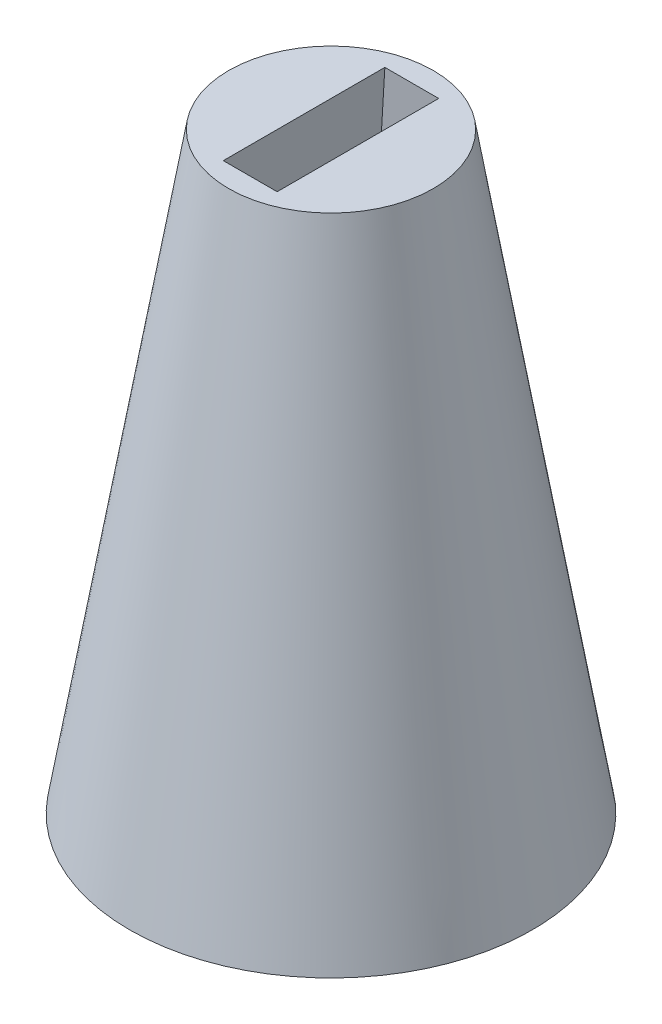
ISO-10303-21;
HEADER;
FILE_DESCRIPTION(('STEP AP214'),'2;1');
FILE_NAME('part.step','',(''),(''),'','','');
FILE_SCHEMA(('AUTOMOTIVE_DESIGN { 1 0 10303 214 1 1 1 1 }'));
ENDSEC;
DATA;
#1=APPLICATION_CONTEXT('core data for automotive mechanical design processes');
#2=APPLICATION_PROTOCOL_DEFINITION('international standard','automotive_design',2000,#1);
#3=PRODUCT_CONTEXT('',#1,'mechanical');
#4=PRODUCT('Part','Part','',(#3));
#5=PRODUCT_RELATED_PRODUCT_CATEGORY('part','',(#4));
#6=PRODUCT_DEFINITION_FORMATION('','',#4);
#7=PRODUCT_DEFINITION_CONTEXT('part definition',#1,'design');
#8=PRODUCT_DEFINITION('design','',#6,#7);
#9=PRODUCT_DEFINITION_SHAPE('','',#8);
#10=(LENGTH_UNIT() NAMED_UNIT(*) SI_UNIT(.MILLI.,.METRE.));
#11=(NAMED_UNIT(*) PLANE_ANGLE_UNIT() SI_UNIT($,.RADIAN.));
#12=(NAMED_UNIT(*) SI_UNIT($,.STERADIAN.) SOLID_ANGLE_UNIT());
#13=UNCERTAINTY_MEASURE_WITH_UNIT(LENGTH_MEASURE(1.E-05),#10,'distance_accuracy_value','');
#14=(GEOMETRIC_REPRESENTATION_CONTEXT(3) GLOBAL_UNCERTAINTY_ASSIGNED_CONTEXT((#13)) GLOBAL_UNIT_ASSIGNED_CONTEXT((#10,
#11,#12)) REPRESENTATION_CONTEXT('',''));
#15=CARTESIAN_POINT('',(0.,0.,0.));
#16=DIRECTION('',(0.,0.,1.));
#17=DIRECTION('',(1.,0.,0.));
#18=AXIS2_PLACEMENT_3D('',#15,#16,#17);
#19=CARTESIAN_POINT('',(0.,55.,0.));
#20=DIRECTION('',(0.,1.,0.));
#21=DIRECTION('',(0.,0.,1.));
#22=AXIS2_PLACEMENT_3D('',#19,#20,#21);
#23=PLANE('',#22);
#24=CARTESIAN_POINT('',(0.,55.,0.));
#25=DIRECTION('',(0.,1.,0.));
#26=DIRECTION('',(0.,0.,1.));
#27=AXIS2_PLACEMENT_3D('',#24,#25,#26);
#28=CIRCLE('',#27,9.5);
#29=CARTESIAN_POINT('',(0.,55.,9.5));
#30=VERTEX_POINT('',#29);
#31=EDGE_CURVE('E64',#30,#30,#28,.T.);
#32=ORIENTED_EDGE('',*,*,#31,.T.);
#33=EDGE_LOOP('',(#32));
#34=FACE_BOUND('',#33,.T.);
#35=DIRECTION('',(1.,0.,0.));
#36=VECTOR('',#35,1.);
#37=CARTESIAN_POINT('',(-2.5,55.,7.5));
#38=LINE('',#37,#36);
#39=CARTESIAN_POINT('',(-2.5,55.,7.5));
#40=VERTEX_POINT('',#39);
#41=CARTESIAN_POINT('',(2.5,55.,7.5));
#42=VERTEX_POINT('',#41);
#43=EDGE_CURVE('E335',#40,#42,#38,.T.);
#44=ORIENTED_EDGE('',*,*,#43,.F.);
#45=DIRECTION('',(0.,0.,1.));
#46=VECTOR('',#45,1.);
#47=CARTESIAN_POINT('',(-2.5,55.,-7.5));
#48=LINE('',#47,#46);
#49=CARTESIAN_POINT('',(-2.5,55.,-7.5));
#50=VERTEX_POINT('',#49);
#51=EDGE_CURVE('E121',#50,#40,#48,.T.);
#52=ORIENTED_EDGE('',*,*,#51,.F.);
#53=DIRECTION('',(-1.,0.,0.));
#54=VECTOR('',#53,1.);
#55=CARTESIAN_POINT('',(-2.5,55.,-7.5));
#56=LINE('',#55,#54);
#57=CARTESIAN_POINT('',(2.5,55.,-7.5));
#58=VERTEX_POINT('',#57);
#59=EDGE_CURVE('E330',#58,#50,#56,.T.);
#60=ORIENTED_EDGE('',*,*,#59,.F.);
#61=DIRECTION('',(0.,0.,-1.));
#62=VECTOR('',#61,1.);
#63=CARTESIAN_POINT('',(2.5,55.,-7.5));
#64=LINE('',#63,#62);
#65=EDGE_CURVE('E164',#42,#58,#64,.T.);
#66=ORIENTED_EDGE('',*,*,#65,.F.);
#67=EDGE_LOOP('',(#44,#52,#60,#66));
#68=FACE_BOUND('',#67,.T.);
#69=ADVANCED_FACE('F53',(#34,#68),#23,.T.);
#70=CARTESIAN_POINT('',(0.,0.,0.));
#71=DIRECTION('',(0.,1.,0.));
#72=DIRECTION('',(0.,0.,1.));
#73=AXIS2_PLACEMENT_3D('',#70,#71,#72);
#74=PLANE('',#73);
#75=DIRECTION('',(-1.,0.,0.));
#76=VECTOR('',#75,1.);
#77=CARTESIAN_POINT('',(-5.75,0.,9.5));
#78=LINE('',#77,#76);
#79=CARTESIAN_POINT('',(5.75,0.,9.5));
#80=VERTEX_POINT('',#79);
#81=CARTESIAN_POINT('',(-5.75,0.,9.5));
#82=VERTEX_POINT('',#81);
#83=EDGE_CURVE('E143',#80,#82,#78,.T.);
#84=ORIENTED_EDGE('',*,*,#83,.F.);
#85=DIRECTION('',(0.,0.,1.));
#86=VECTOR('',#85,1.);
#87=CARTESIAN_POINT('',(5.75,0.,9.5));
#88=LINE('',#87,#86);
#89=CARTESIAN_POINT('',(5.75000000000001,0.,-9.5));
#90=VERTEX_POINT('',#89);
#91=EDGE_CURVE('E80',#90,#80,#88,.T.);
#92=ORIENTED_EDGE('',*,*,#91,.F.);
#93=DIRECTION('',(1.,0.,0.));
#94=VECTOR('',#93,1.);
#95=CARTESIAN_POINT('',(-5.75,0.,-9.5));
#96=LINE('',#95,#94);
#97=CARTESIAN_POINT('',(-5.75,0.,-9.5));
#98=VERTEX_POINT('',#97);
#99=EDGE_CURVE('E202',#98,#90,#96,.T.);
#100=ORIENTED_EDGE('',*,*,#99,.F.);
#101=DIRECTION('',(0.,0.,-1.));
#102=VECTOR('',#101,1.);
#103=CARTESIAN_POINT('',(-5.75,0.,9.5));
#104=LINE('',#103,#102);
#105=EDGE_CURVE('E323',#82,#98,#104,.T.);
#106=ORIENTED_EDGE('',*,*,#105,.F.);
#107=EDGE_LOOP('',(#84,#92,#100,#106));
#108=FACE_BOUND('',#107,.T.);
#109=CARTESIAN_POINT('',(0.,0.,0.));
#110=DIRECTION('',(0.,1.,0.));
#111=DIRECTION('',(0.,0.,1.));
#112=AXIS2_PLACEMENT_3D('',#109,#110,#111);
#113=CIRCLE('',#112,18.7);
#114=CARTESIAN_POINT('',(0.,0.,18.7));
#115=VERTEX_POINT('',#114);
#116=EDGE_CURVE('E12',#115,#115,#113,.T.);
#117=ORIENTED_EDGE('',*,*,#116,.F.);
#118=EDGE_LOOP('',(#117));
#119=FACE_BOUND('',#118,.T.);
#120=ADVANCED_FACE('F55',(#108,#119),#74,.F.);
#121=CARTESIAN_POINT('',(0.,55.,0.));
#122=DIRECTION('',(0.,-1.,0.));
#123=DIRECTION('',(0.,0.,-1.));
#124=AXIS2_PLACEMENT_3D('',#121,#122,#123);
#125=CONICAL_SURFACE('',#124,9.5,0.165738299987808);
#126=ORIENTED_EDGE('',*,*,#31,.F.);
#127=EDGE_LOOP('',(#126));
#128=FACE_BOUND('',#127,.T.);
#129=ORIENTED_EDGE('',*,*,#116,.T.);
#130=EDGE_LOOP('',(#129));
#131=FACE_BOUND('',#130,.T.);
#132=ADVANCED_FACE('F273',(#128,#131),#125,.T.);
#133=CARTESIAN_POINT('',(5.75,32.,9.5));
#134=DIRECTION('',(1.,0.,0.));
#135=DIRECTION('',(0.,0.,-1.));
#136=AXIS2_PLACEMENT_3D('',#133,#134,#135);
#137=PLANE('',#136);
#138=ORIENTED_EDGE('',*,*,#91,.T.);
#139=DIRECTION('',(0.,-1.,0.));
#140=VECTOR('',#139,1.);
#141=CARTESIAN_POINT('',(5.75,32.,9.5));
#142=LINE('',#141,#140);
#143=CARTESIAN_POINT('',(5.75,32.,9.5));
#144=VERTEX_POINT('',#143);
#145=EDGE_CURVE('E149',#144,#80,#142,.T.);
#146=ORIENTED_EDGE('',*,*,#145,.F.);
#147=DIRECTION('',(0.,0.,1.));
#148=VECTOR('',#147,1.);
#149=CARTESIAN_POINT('',(5.75,32.,9.5));
#150=LINE('',#149,#148);
#151=CARTESIAN_POINT('',(5.75000000000001,32.,-9.5));
#152=VERTEX_POINT('',#151);
#153=EDGE_CURVE('E135',#152,#144,#150,.T.);
#154=ORIENTED_EDGE('',*,*,#153,.F.);
#155=DIRECTION('',(0.,-1.,0.));
#156=VECTOR('',#155,1.);
#157=CARTESIAN_POINT('',(5.75000000000001,32.,-9.5));
#158=LINE('',#157,#156);
#159=EDGE_CURVE('E212',#152,#90,#158,.T.);
#160=ORIENTED_EDGE('',*,*,#159,.T.);
#161=EDGE_LOOP('',(#138,#146,#154,#160));
#162=FACE_BOUND('',#161,.T.);
#163=ADVANCED_FACE('F181',(#162),#137,.F.);
#164=CARTESIAN_POINT('',(-5.75,32.,-9.5));
#165=DIRECTION('',(0.,0.,-1.));
#166=DIRECTION('',(-1.,0.,0.));
#167=AXIS2_PLACEMENT_3D('',#164,#165,#166);
#168=PLANE('',#167);
#169=ORIENTED_EDGE('',*,*,#99,.T.);
#170=ORIENTED_EDGE('',*,*,#159,.F.);
#171=DIRECTION('',(1.,0.,0.));
#172=VECTOR('',#171,1.);
#173=CARTESIAN_POINT('',(-5.75,32.,-9.5));
#174=LINE('',#173,#172);
#175=CARTESIAN_POINT('',(-5.75,32.,-9.5));
#176=VERTEX_POINT('',#175);
#177=EDGE_CURVE('E155',#176,#152,#174,.T.);
#178=ORIENTED_EDGE('',*,*,#177,.F.);
#179=DIRECTION('',(0.,-1.,0.));
#180=VECTOR('',#179,1.);
#181=CARTESIAN_POINT('',(-5.75,32.,-9.5));
#182=LINE('',#181,#180);
#183=EDGE_CURVE('E148',#176,#98,#182,.T.);
#184=ORIENTED_EDGE('',*,*,#183,.T.);
#185=EDGE_LOOP('',(#169,#170,#178,#184));
#186=FACE_BOUND('',#185,.T.);
#187=ADVANCED_FACE('F175',(#186),#168,.F.);
#188=CARTESIAN_POINT('',(-5.75,32.,9.5));
#189=DIRECTION('',(-1.,0.,0.));
#190=DIRECTION('',(0.,0.,1.));
#191=AXIS2_PLACEMENT_3D('',#188,#189,#190);
#192=PLANE('',#191);
#193=ORIENTED_EDGE('',*,*,#105,.T.);
#194=ORIENTED_EDGE('',*,*,#183,.F.);
#195=DIRECTION('',(0.,0.,-1.));
#196=VECTOR('',#195,1.);
#197=CARTESIAN_POINT('',(-5.75,32.,9.5));
#198=LINE('',#197,#196);
#199=CARTESIAN_POINT('',(-5.75,32.,9.5));
#200=VERTEX_POINT('',#199);
#201=EDGE_CURVE('E117',#200,#176,#198,.T.);
#202=ORIENTED_EDGE('',*,*,#201,.F.);
#203=DIRECTION('',(0.,-1.,0.));
#204=VECTOR('',#203,1.);
#205=CARTESIAN_POINT('',(-5.75,32.,9.5));
#206=LINE('',#205,#204);
#207=EDGE_CURVE('E140',#200,#82,#206,.T.);
#208=ORIENTED_EDGE('',*,*,#207,.T.);
#209=EDGE_LOOP('',(#193,#194,#202,#208));
#210=FACE_BOUND('',#209,.T.);
#211=ADVANCED_FACE('F152',(#210),#192,.F.);
#212=CARTESIAN_POINT('',(-5.75,32.,9.5));
#213=DIRECTION('',(0.,0.,1.));
#214=DIRECTION('',(1.,0.,0.));
#215=AXIS2_PLACEMENT_3D('',#212,#213,#214);
#216=PLANE('',#215);
#217=ORIENTED_EDGE('',*,*,#83,.T.);
#218=ORIENTED_EDGE('',*,*,#207,.F.);
#219=DIRECTION('',(-1.,0.,0.));
#220=VECTOR('',#219,1.);
#221=CARTESIAN_POINT('',(-5.75,32.,9.5));
#222=LINE('',#221,#220);
#223=EDGE_CURVE('E128',#144,#200,#222,.T.);
#224=ORIENTED_EDGE('',*,*,#223,.F.);
#225=ORIENTED_EDGE('',*,*,#145,.T.);
#226=EDGE_LOOP('',(#217,#218,#224,#225));
#227=FACE_BOUND('',#226,.T.);
#228=ADVANCED_FACE('F141',(#227),#216,.F.);
#229=CARTESIAN_POINT('',(-10.0706590988069,1.42302791613576,0.));
#230=DIRECTION('',(0.990163599913086,-0.139914421726849,0.));
#231=DIRECTION('',(0.139914421726849,0.990163599913086,0.));
#232=AXIS2_PLACEMENT_3D('',#229,#230,#231);
#233=PLANE('',#232);
#234=DIRECTION('',(0.139398665853922,0.986513635273912,-0.0857837943716444));
#235=VECTOR('',#234,1.);
#236=CARTESIAN_POINT('',(-5.75,32.,9.5));
#237=LINE('',#236,#235);
#238=EDGE_CURVE('E112',#200,#40,#237,.T.);
#239=ORIENTED_EDGE('',*,*,#238,.F.);
#240=ORIENTED_EDGE('',*,*,#201,.T.);
#241=DIRECTION('',(0.139398665853922,0.986513635273912,0.0857837943716448));
#242=VECTOR('',#241,1.);
#243=CARTESIAN_POINT('',(-5.75,32.,-9.5));
#244=LINE('',#243,#242);
#245=EDGE_CURVE('E125',#176,#50,#244,.T.);
#246=ORIENTED_EDGE('',*,*,#245,.T.);
#247=ORIENTED_EDGE('',*,*,#51,.T.);
#248=EDGE_LOOP('',(#239,#240,#246,#247));
#249=FACE_BOUND('',#248,.T.);
#250=ADVANCED_FACE('F114',(#249),#233,.T.);
#251=CARTESIAN_POINT('',(0.,1.06003752345216,-12.1904315196998));
#252=DIRECTION('',(0.,-0.0866296163648422,0.996240588195683));
#253=DIRECTION('',(0.,-0.996240588195683,-0.0866296163648422));
#254=AXIS2_PLACEMENT_3D('',#251,#252,#253);
#255=PLANE('',#254);
#256=ORIENTED_EDGE('',*,*,#245,.F.);
#257=ORIENTED_EDGE('',*,*,#177,.T.);
#258=DIRECTION('',(-0.139398665853923,0.986513635273912,0.0857837943716448));
#259=VECTOR('',#258,1.);
#260=CARTESIAN_POINT('',(5.75000000000001,32.,-9.5));
#261=LINE('',#260,#259);
#262=EDGE_CURVE('E216',#152,#58,#261,.T.);
#263=ORIENTED_EDGE('',*,*,#262,.T.);
#264=ORIENTED_EDGE('',*,*,#59,.T.);
#265=EDGE_LOOP('',(#256,#257,#263,#264));
#266=FACE_BOUND('',#265,.T.);
#267=ADVANCED_FACE('F237',(#266),#255,.T.);
#268=CARTESIAN_POINT('',(0.,1.06003752345215,12.1904315196998));
#269=DIRECTION('',(0.,-0.0866296163648418,-0.996240588195683));
#270=DIRECTION('',(0.,0.996240588195683,-0.0866296163648418));
#271=AXIS2_PLACEMENT_3D('',#268,#269,#270);
#272=PLANE('',#271);
#273=DIRECTION('',(-0.139398665853922,0.986513635273912,-0.0857837943716444));
#274=VECTOR('',#273,1.);
#275=CARTESIAN_POINT('',(5.75,32.,9.5));
#276=LINE('',#275,#274);
#277=EDGE_CURVE('E72',#144,#42,#276,.T.);
#278=ORIENTED_EDGE('',*,*,#277,.F.);
#279=ORIENTED_EDGE('',*,*,#223,.T.);
#280=ORIENTED_EDGE('',*,*,#238,.T.);
#281=ORIENTED_EDGE('',*,*,#43,.T.);
#282=EDGE_LOOP('',(#278,#279,#280,#281));
#283=FACE_BOUND('',#282,.T.);
#284=ADVANCED_FACE('F131',(#283),#272,.T.);
#285=CARTESIAN_POINT('',(10.0706590988069,1.42302791613576,0.));
#286=DIRECTION('',(-0.990163599913086,-0.139914421726849,0.));
#287=DIRECTION('',(0.139914421726849,-0.990163599913086,0.));
#288=AXIS2_PLACEMENT_3D('',#285,#286,#287);
#289=PLANE('',#288);
#290=ORIENTED_EDGE('',*,*,#262,.F.);
#291=ORIENTED_EDGE('',*,*,#153,.T.);
#292=ORIENTED_EDGE('',*,*,#277,.T.);
#293=ORIENTED_EDGE('',*,*,#65,.T.);
#294=EDGE_LOOP('',(#290,#291,#292,#293));
#295=FACE_BOUND('',#294,.T.);
#296=ADVANCED_FACE('F215',(#295),#289,.T.);
#297=CLOSED_SHELL('',(#69,#120,#132,#163,#187,#211,#228,#250,#267,#284,#296));
#298=MANIFOLD_SOLID_BREP('B2',#297);
#299=ADVANCED_BREP_SHAPE_REPRESENTATION('',(#18,#298),#14);
#300=SHAPE_DEFINITION_REPRESENTATION(#9,#299);
ENDSEC;
END-ISO-10303-21;
